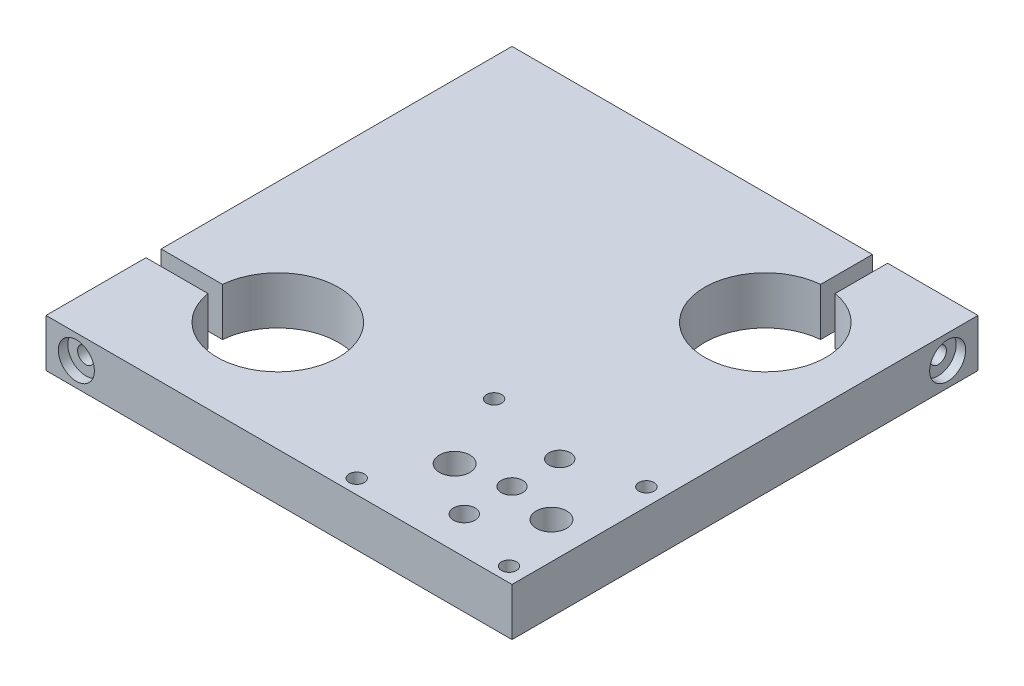
ISO-10303-21;
HEADER;
FILE_DESCRIPTION(('STEP AP214'),'2;1');
FILE_NAME('part.step','',(''),(''),'','','');
FILE_SCHEMA(('AUTOMOTIVE_DESIGN { 1 0 10303 214 1 1 1 1 }'));
ENDSEC;
DATA;
#1=APPLICATION_CONTEXT('core data for automotive mechanical design processes');
#2=APPLICATION_PROTOCOL_DEFINITION('international standard','automotive_design',2000,#1);
#3=PRODUCT_CONTEXT('',#1,'mechanical');
#4=PRODUCT('Part','Part','',(#3));
#5=PRODUCT_RELATED_PRODUCT_CATEGORY('part','',(#4));
#6=PRODUCT_DEFINITION_FORMATION('','',#4);
#7=PRODUCT_DEFINITION_CONTEXT('part definition',#1,'design');
#8=PRODUCT_DEFINITION('design','',#6,#7);
#9=PRODUCT_DEFINITION_SHAPE('','',#8);
#10=(LENGTH_UNIT() NAMED_UNIT(*) SI_UNIT(.MILLI.,.METRE.));
#11=(NAMED_UNIT(*) PLANE_ANGLE_UNIT() SI_UNIT($,.RADIAN.));
#12=(NAMED_UNIT(*) SI_UNIT($,.STERADIAN.) SOLID_ANGLE_UNIT());
#13=UNCERTAINTY_MEASURE_WITH_UNIT(LENGTH_MEASURE(1.E-05),#10,'distance_accuracy_value','');
#14=(GEOMETRIC_REPRESENTATION_CONTEXT(3) GLOBAL_UNCERTAINTY_ASSIGNED_CONTEXT((#13)) GLOBAL_UNIT_ASSIGNED_CONTEXT((#10,
#11,#12)) REPRESENTATION_CONTEXT('',''));
#15=CARTESIAN_POINT('',(0.,0.,0.));
#16=DIRECTION('',(0.,0.,1.));
#17=DIRECTION('',(1.,0.,0.));
#18=AXIS2_PLACEMENT_3D('',#15,#16,#17);
#19=CARTESIAN_POINT('',(0.,0.,0.));
#20=DIRECTION('',(0.,1.,0.));
#21=DIRECTION('',(0.,0.,1.));
#22=AXIS2_PLACEMENT_3D('',#19,#20,#21);
#23=PLANE('',#22);
#24=CARTESIAN_POINT('',(41.13,0.,32.875));
#25=DIRECTION('',(0.,-1.,0.));
#26=DIRECTION('',(0.,0.,-1.));
#27=AXIS2_PLACEMENT_3D('',#24,#25,#26);
#28=CIRCLE('',#27,3.175);
#29=CARTESIAN_POINT('',(41.13,0.,29.7));
#30=VERTEX_POINT('',#29);
#31=EDGE_CURVE('E343',#30,#30,#28,.T.);
#32=ORIENTED_EDGE('',*,*,#31,.F.);
#33=EDGE_LOOP('',(#32));
#34=FACE_BOUND('',#33,.T.);
#35=CARTESIAN_POINT('',(31.,0.,21.01224));
#36=DIRECTION('',(0.,-1.,0.));
#37=DIRECTION('',(0.,0.,-1.));
#38=AXIS2_PLACEMENT_3D('',#35,#36,#37);
#39=CIRCLE('',#38,4.7625);
#40=CARTESIAN_POINT('',(31.,0.,16.24974));
#41=VERTEX_POINT('',#40);
#42=EDGE_CURVE('E325',#41,#41,#39,.T.);
#43=ORIENTED_EDGE('',*,*,#42,.F.);
#44=EDGE_LOOP('',(#43));
#45=FACE_BOUND('',#44,.T.);
#46=CARTESIAN_POINT('',(13.25,0.,45.75));
#47=DIRECTION('',(0.,-1.,0.));
#48=DIRECTION('',(0.,0.,-1.));
#49=AXIS2_PLACEMENT_3D('',#46,#47,#48);
#50=CIRCLE('',#49,1.58749999999999);
#51=CARTESIAN_POINT('',(13.25,0.,44.1625));
#52=VERTEX_POINT('',#51);
#53=EDGE_CURVE('E301',#52,#52,#50,.T.);
#54=ORIENTED_EDGE('',*,*,#53,.F.);
#55=EDGE_LOOP('',(#54));
#56=FACE_BOUND('',#55,.T.);
#57=CARTESIAN_POINT('',(45.12,0.,45.75));
#58=DIRECTION('',(0.,-1.,0.));
#59=DIRECTION('',(0.,0.,-1.));
#60=AXIS2_PLACEMENT_3D('',#57,#58,#59);
#61=CIRCLE('',#60,1.58749999999998);
#62=CARTESIAN_POINT('',(45.12,0.,44.1625));
#63=VERTEX_POINT('',#62);
#64=EDGE_CURVE('E295',#63,#63,#61,.T.);
#65=ORIENTED_EDGE('',*,*,#64,.F.);
#66=EDGE_LOOP('',(#65));
#67=FACE_BOUND('',#66,.T.);
#68=CARTESIAN_POINT('',(45.12,0.,17.));
#69=DIRECTION('',(0.,-1.,0.));
#70=DIRECTION('',(0.,0.,-1.));
#71=AXIS2_PLACEMENT_3D('',#68,#69,#70);
#72=CIRCLE('',#71,1.58749999999998);
#73=CARTESIAN_POINT('',(45.12,0.,15.4125));
#74=VERTEX_POINT('',#73);
#75=EDGE_CURVE('E283',#74,#74,#72,.T.);
#76=ORIENTED_EDGE('',*,*,#75,.F.);
#77=EDGE_LOOP('',(#76));
#78=FACE_BOUND('',#77,.T.);
#79=DIRECTION('',(-1.,0.,0.));
#80=VECTOR('',#79,1.);
#81=CARTESIAN_POINT('',(-48.75,0.,-48.75));
#82=LINE('',#81,#80);
#83=CARTESIAN_POINT('',(26.6625,0.,-48.75));
#84=VERTEX_POINT('',#83);
#85=CARTESIAN_POINT('',(-48.75,0.,-48.75));
#86=VERTEX_POINT('',#85);
#87=EDGE_CURVE('E166',#84,#86,#82,.T.);
#88=ORIENTED_EDGE('',*,*,#87,.F.);
#89=DIRECTION('',(0.,0.,-1.));
#90=VECTOR('',#89,1.);
#91=CARTESIAN_POINT('',(26.6625,0.,48.751));
#92=LINE('',#91,#90);
#93=CARTESIAN_POINT('',(26.6625,0.,-37.9033530635164));
#94=VERTEX_POINT('',#93);
#95=EDGE_CURVE('E127',#94,#84,#92,.T.);
#96=ORIENTED_EDGE('',*,*,#95,.F.);
#97=CARTESIAN_POINT('',(27.75,0.,-25.25));
#98=DIRECTION('',(0.,1.,0.));
#99=DIRECTION('',(0.,0.,1.));
#100=AXIS2_PLACEMENT_3D('',#97,#98,#99);
#101=CIRCLE('',#100,12.7);
#102=CARTESIAN_POINT('',(29.8375,0.,-37.7772640169352));
#103=VERTEX_POINT('',#102);
#104=EDGE_CURVE('E207',#103,#94,#101,.F.);
#105=ORIENTED_EDGE('',*,*,#104,.F.);
#106=DIRECTION('',(0.,0.,-1.));
#107=VECTOR('',#106,1.);
#108=CARTESIAN_POINT('',(29.8375,0.,48.751));
#109=LINE('',#108,#107);
#110=CARTESIAN_POINT('',(29.8375,0.,-48.75));
#111=VERTEX_POINT('',#110);
#112=EDGE_CURVE('E52',#103,#111,#109,.T.);
#113=ORIENTED_EDGE('',*,*,#112,.T.);
#114=CARTESIAN_POINT('',(48.75,0.,-48.75));
#115=VERTEX_POINT('',#114);
#116=EDGE_CURVE('E168',#115,#111,#82,.T.);
#117=ORIENTED_EDGE('',*,*,#116,.F.);
#118=DIRECTION('',(0.,0.,-1.));
#119=VECTOR('',#118,1.);
#120=CARTESIAN_POINT('',(48.75,0.,-48.75));
#121=LINE('',#120,#119);
#122=CARTESIAN_POINT('',(48.75,0.,48.75));
#123=VERTEX_POINT('',#122);
#124=EDGE_CURVE('E163',#123,#115,#121,.T.);
#125=ORIENTED_EDGE('',*,*,#124,.F.);
#126=DIRECTION('',(1.,0.,0.));
#127=VECTOR('',#126,1.);
#128=CARTESIAN_POINT('',(-48.75,0.,48.75));
#129=LINE('',#128,#127);
#130=CARTESIAN_POINT('',(-48.75,0.,48.75));
#131=VERTEX_POINT('',#130);
#132=EDGE_CURVE('E154',#131,#123,#129,.T.);
#133=ORIENTED_EDGE('',*,*,#132,.F.);
#134=DIRECTION('',(0.,0.,1.));
#135=VECTOR('',#134,1.);
#136=CARTESIAN_POINT('',(-48.75,0.,-48.75));
#137=LINE('',#136,#135);
#138=CARTESIAN_POINT('',(-48.75,0.,27.8375));
#139=VERTEX_POINT('',#138);
#140=EDGE_CURVE('E171',#139,#131,#137,.T.);
#141=ORIENTED_EDGE('',*,*,#140,.F.);
#142=DIRECTION('',(-1.,0.,0.));
#143=VECTOR('',#142,1.);
#144=CARTESIAN_POINT('',(48.751,0.,27.8375));
#145=LINE('',#144,#143);
#146=CARTESIAN_POINT('',(-35.7772640169352,0.,27.8375));
#147=VERTEX_POINT('',#146);
#148=EDGE_CURVE('E193',#147,#139,#145,.T.);
#149=ORIENTED_EDGE('',*,*,#148,.F.);
#150=CARTESIAN_POINT('',(-23.25,0.,25.75));
#151=DIRECTION('',(0.,1.,0.));
#152=DIRECTION('',(0.,0.,1.));
#153=AXIS2_PLACEMENT_3D('',#150,#151,#152);
#154=CIRCLE('',#153,12.7);
#155=CARTESIAN_POINT('',(-35.9033530635164,0.,24.6625));
#156=VERTEX_POINT('',#155);
#157=EDGE_CURVE('E167',#156,#147,#154,.F.);
#158=ORIENTED_EDGE('',*,*,#157,.F.);
#159=DIRECTION('',(-1.,0.,0.));
#160=VECTOR('',#159,1.);
#161=CARTESIAN_POINT('',(48.751,0.,24.6625));
#162=LINE('',#161,#160);
#163=CARTESIAN_POINT('',(-48.75,0.,24.6625));
#164=VERTEX_POINT('',#163);
#165=EDGE_CURVE('E188',#156,#164,#162,.T.);
#166=ORIENTED_EDGE('',*,*,#165,.T.);
#167=EDGE_CURVE('E172',#86,#164,#137,.T.);
#168=ORIENTED_EDGE('',*,*,#167,.F.);
#169=EDGE_LOOP('',(#88,#96,#105,#113,#117,#125,#133,#141,#149,#158,#166,#168));
#170=FACE_BOUND('',#169,.T.);
#171=CARTESIAN_POINT('',(13.25,0.,17.));
#172=DIRECTION('',(0.,-1.,0.));
#173=DIRECTION('',(0.,0.,-1.));
#174=AXIS2_PLACEMENT_3D('',#171,#172,#173);
#175=CIRCLE('',#174,1.58749999999999);
#176=CARTESIAN_POINT('',(13.25,0.,15.4125));
#177=VERTEX_POINT('',#176);
#178=EDGE_CURVE('E289',#177,#177,#175,.T.);
#179=ORIENTED_EDGE('',*,*,#178,.F.);
#180=EDGE_LOOP('',(#179));
#181=FACE_BOUND('',#180,.T.);
#182=CARTESIAN_POINT('',(31.,0.,30.9970661848214));
#183=DIRECTION('',(0.,-1.,0.));
#184=DIRECTION('',(0.,0.,-1.));
#185=AXIS2_PLACEMENT_3D('',#182,#183,#184);
#186=CIRCLE('',#185,4.7625);
#187=CARTESIAN_POINT('',(31.,0.,26.2345661848214));
#188=VERTEX_POINT('',#187);
#189=EDGE_CURVE('E313',#188,#188,#186,.T.);
#190=ORIENTED_EDGE('',*,*,#189,.F.);
#191=EDGE_LOOP('',(#190));
#192=FACE_BOUND('',#191,.T.);
#193=CARTESIAN_POINT('',(31.,0.,40.98776));
#194=DIRECTION('',(0.,-1.,0.));
#195=DIRECTION('',(0.,0.,-1.));
#196=AXIS2_PLACEMENT_3D('',#193,#194,#195);
#197=CIRCLE('',#196,4.7625);
#198=CARTESIAN_POINT('',(31.,0.,36.22526));
#199=VERTEX_POINT('',#198);
#200=EDGE_CURVE('E337',#199,#199,#197,.T.);
#201=ORIENTED_EDGE('',*,*,#200,.F.);
#202=EDGE_LOOP('',(#201));
#203=FACE_BOUND('',#202,.T.);
#204=CARTESIAN_POINT('',(20.87,0.,32.875));
#205=DIRECTION('',(0.,-1.,0.));
#206=DIRECTION('',(0.,0.,-1.));
#207=AXIS2_PLACEMENT_3D('',#204,#205,#206);
#208=CIRCLE('',#207,3.175);
#209=CARTESIAN_POINT('',(20.87,0.,29.7));
#210=VERTEX_POINT('',#209);
#211=EDGE_CURVE('E349',#210,#210,#208,.T.);
#212=ORIENTED_EDGE('',*,*,#211,.F.);
#213=EDGE_LOOP('',(#212));
#214=FACE_BOUND('',#213,.T.);
#215=ADVANCED_FACE('F37',(#34,#45,#56,#67,#78,#170,#181,#192,#203,#214),#23,.F.);
#216=CARTESIAN_POINT('',(-48.75,10.,48.75));
#217=DIRECTION('',(0.,0.,-1.));
#218=DIRECTION('',(-1.,0.,0.));
#219=AXIS2_PLACEMENT_3D('',#216,#217,#218);
#220=PLANE('',#219);
#221=ORIENTED_EDGE('',*,*,#132,.T.);
#222=DIRECTION('',(0.,-1.,0.));
#223=VECTOR('',#222,1.);
#224=CARTESIAN_POINT('',(48.75,10.,48.75));
#225=LINE('',#224,#223);
#226=CARTESIAN_POINT('',(48.75,10.,48.75));
#227=VERTEX_POINT('',#226);
#228=EDGE_CURVE('E162',#227,#123,#225,.T.);
#229=ORIENTED_EDGE('',*,*,#228,.F.);
#230=DIRECTION('',(1.,0.,0.));
#231=VECTOR('',#230,1.);
#232=CARTESIAN_POINT('',(-48.75,10.,48.75));
#233=LINE('',#232,#231);
#234=CARTESIAN_POINT('',(-48.75,10.,48.75));
#235=VERTEX_POINT('',#234);
#236=EDGE_CURVE('E160',#235,#227,#233,.T.);
#237=ORIENTED_EDGE('',*,*,#236,.F.);
#238=DIRECTION('',(0.,-1.,0.));
#239=VECTOR('',#238,1.);
#240=CARTESIAN_POINT('',(-48.75,10.,48.75));
#241=LINE('',#240,#239);
#242=EDGE_CURVE('E178',#235,#131,#241,.T.);
#243=ORIENTED_EDGE('',*,*,#242,.T.);
#244=EDGE_LOOP('',(#221,#229,#237,#243));
#245=FACE_BOUND('',#244,.T.);
#246=CARTESIAN_POINT('',(-42.4,5.,48.75));
#247=DIRECTION('',(0.,0.,1.));
#248=DIRECTION('',(1.,0.,0.));
#249=AXIS2_PLACEMENT_3D('',#246,#247,#248);
#250=CIRCLE('',#249,3.77062999999999);
#251=CARTESIAN_POINT('',(-38.62937,5.,48.75));
#252=VERTEX_POINT('',#251);
#253=EDGE_CURVE('E265',#252,#252,#250,.T.);
#254=ORIENTED_EDGE('',*,*,#253,.F.);
#255=EDGE_LOOP('',(#254));
#256=FACE_BOUND('',#255,.T.);
#257=ADVANCED_FACE('F243',(#245,#256),#220,.F.);
#258=CARTESIAN_POINT('',(48.751,0.,27.8375));
#259=DIRECTION('',(0.,0.,1.));
#260=DIRECTION('',(1.,0.,0.));
#261=AXIS2_PLACEMENT_3D('',#258,#259,#260);
#262=PLANE('',#261);
#263=DIRECTION('',(0.,1.,0.));
#264=VECTOR('',#263,1.);
#265=CARTESIAN_POINT('',(-35.7772640169352,-0.000999999999999265,27.8375));
#266=LINE('',#265,#264);
#267=CARTESIAN_POINT('',(-35.7772640169352,10.,27.8375));
#268=VERTEX_POINT('',#267);
#269=EDGE_CURVE('E214',#268,#147,#266,.F.);
#270=ORIENTED_EDGE('',*,*,#269,.T.);
#271=ORIENTED_EDGE('',*,*,#148,.T.);
#272=DIRECTION('',(0.,1.,0.));
#273=VECTOR('',#272,1.);
#274=CARTESIAN_POINT('',(-48.75,0.,27.8375));
#275=LINE('',#274,#273);
#276=CARTESIAN_POINT('',(-48.75,9.99999999999999,27.8375));
#277=VERTEX_POINT('',#276);
#278=EDGE_CURVE('E223',#139,#277,#275,.T.);
#279=ORIENTED_EDGE('',*,*,#278,.T.);
#280=DIRECTION('',(-1.,0.,0.));
#281=VECTOR('',#280,1.);
#282=CARTESIAN_POINT('',(48.751,9.99999999999999,27.8375));
#283=LINE('',#282,#281);
#284=EDGE_CURVE('E196',#268,#277,#283,.T.);
#285=ORIENTED_EDGE('',*,*,#284,.F.);
#286=EDGE_LOOP('',(#270,#271,#279,#285));
#287=FACE_BOUND('',#286,.T.);
#288=CARTESIAN_POINT('',(-42.4,5.,27.8375));
#289=DIRECTION('',(0.,0.,1.));
#290=DIRECTION('',(1.,0.,0.));
#291=AXIS2_PLACEMENT_3D('',#288,#289,#290);
#292=CIRCLE('',#291,1.7272);
#293=CARTESIAN_POINT('',(-40.6728,5.,27.8375));
#294=VERTEX_POINT('',#293);
#295=EDGE_CURVE('E253',#294,#294,#292,.F.);
#296=ORIENTED_EDGE('',*,*,#295,.F.);
#297=EDGE_LOOP('',(#296));
#298=FACE_BOUND('',#297,.T.);
#299=ADVANCED_FACE('F231',(#287,#298),#262,.F.);
#300=CARTESIAN_POINT('',(-48.75,10.,-48.75));
#301=DIRECTION('',(0.,0.,1.));
#302=DIRECTION('',(1.,0.,0.));
#303=AXIS2_PLACEMENT_3D('',#300,#301,#302);
#304=PLANE('',#303);
#305=DIRECTION('',(-1.,0.,0.));
#306=VECTOR('',#305,1.);
#307=CARTESIAN_POINT('',(-48.75,10.,-48.75));
#308=LINE('',#307,#306);
#309=CARTESIAN_POINT('',(26.6625,10.,-48.75));
#310=VERTEX_POINT('',#309);
#311=CARTESIAN_POINT('',(-48.75,10.,-48.75));
#312=VERTEX_POINT('',#311);
#313=EDGE_CURVE('E138',#310,#312,#308,.T.);
#314=ORIENTED_EDGE('',*,*,#313,.F.);
#315=DIRECTION('',(0.,1.,0.));
#316=VECTOR('',#315,1.);
#317=CARTESIAN_POINT('',(26.6625,10.,-48.75));
#318=LINE('',#317,#316);
#319=EDGE_CURVE('E124',#84,#310,#318,.T.);
#320=ORIENTED_EDGE('',*,*,#319,.F.);
#321=ORIENTED_EDGE('',*,*,#87,.T.);
#322=DIRECTION('',(0.,-1.,0.));
#323=VECTOR('',#322,1.);
#324=CARTESIAN_POINT('',(-48.75,10.,-48.75));
#325=LINE('',#324,#323);
#326=EDGE_CURVE('E45',#312,#86,#325,.T.);
#327=ORIENTED_EDGE('',*,*,#326,.F.);
#328=EDGE_LOOP('',(#314,#320,#321,#327));
#329=FACE_BOUND('',#328,.T.);
#330=ADVANCED_FACE('F145',(#329),#304,.F.);
#331=CARTESIAN_POINT('',(-48.75,10.,-48.75));
#332=DIRECTION('',(1.,0.,0.));
#333=DIRECTION('',(0.,0.,-1.));
#334=AXIS2_PLACEMENT_3D('',#331,#332,#333);
#335=PLANE('',#334);
#336=ORIENTED_EDGE('',*,*,#167,.T.);
#337=DIRECTION('',(0.,-1.,0.));
#338=VECTOR('',#337,1.);
#339=CARTESIAN_POINT('',(-48.75,0.,24.6625));
#340=LINE('',#339,#338);
#341=CARTESIAN_POINT('',(-48.75,10.,24.6625));
#342=VERTEX_POINT('',#341);
#343=EDGE_CURVE('E198',#342,#164,#340,.T.);
#344=ORIENTED_EDGE('',*,*,#343,.F.);
#345=DIRECTION('',(0.,0.,1.));
#346=VECTOR('',#345,1.);
#347=CARTESIAN_POINT('',(-48.75,10.,-48.75));
#348=LINE('',#347,#346);
#349=EDGE_CURVE('E158',#312,#342,#348,.T.);
#350=ORIENTED_EDGE('',*,*,#349,.F.);
#351=ORIENTED_EDGE('',*,*,#326,.T.);
#352=EDGE_LOOP('',(#336,#344,#350,#351));
#353=FACE_BOUND('',#352,.T.);
#354=ADVANCED_FACE('F182',(#353),#335,.F.);
#355=CARTESIAN_POINT('',(48.75,10.,-48.75));
#356=DIRECTION('',(-1.,0.,0.));
#357=DIRECTION('',(0.,0.,1.));
#358=AXIS2_PLACEMENT_3D('',#355,#356,#357);
#359=PLANE('',#358);
#360=CARTESIAN_POINT('',(48.75,5.,-42.4));
#361=DIRECTION('',(1.,0.,0.));
#362=DIRECTION('',(0.,0.,-1.));
#363=AXIS2_PLACEMENT_3D('',#360,#361,#362);
#364=CIRCLE('',#363,3.77062999999999);
#365=CARTESIAN_POINT('',(48.75,5.,-46.17063));
#366=VERTEX_POINT('',#365);
#367=EDGE_CURVE('E272',#366,#366,#364,.T.);
#368=ORIENTED_EDGE('',*,*,#367,.F.);
#369=EDGE_LOOP('',(#368));
#370=FACE_BOUND('',#369,.T.);
#371=ORIENTED_EDGE('',*,*,#124,.T.);
#372=DIRECTION('',(0.,-1.,0.));
#373=VECTOR('',#372,1.);
#374=CARTESIAN_POINT('',(48.75,10.,-48.75));
#375=LINE('',#374,#373);
#376=CARTESIAN_POINT('',(48.75,10.,-48.75));
#377=VERTEX_POINT('',#376);
#378=EDGE_CURVE('E11',#377,#115,#375,.T.);
#379=ORIENTED_EDGE('',*,*,#378,.F.);
#380=DIRECTION('',(0.,0.,-1.));
#381=VECTOR('',#380,1.);
#382=CARTESIAN_POINT('',(48.75,10.,-48.75));
#383=LINE('',#382,#381);
#384=EDGE_CURVE('E149',#227,#377,#383,.T.);
#385=ORIENTED_EDGE('',*,*,#384,.F.);
#386=ORIENTED_EDGE('',*,*,#228,.T.);
#387=EDGE_LOOP('',(#371,#379,#385,#386));
#388=FACE_BOUND('',#387,.T.);
#389=ADVANCED_FACE('F39',(#370,#388),#359,.F.);
#390=ORIENTED_EDGE('',*,*,#116,.T.);
#391=DIRECTION('',(0.,-1.,0.));
#392=VECTOR('',#391,1.);
#393=CARTESIAN_POINT('',(29.8375,10.,-48.75));
#394=LINE('',#393,#392);
#395=CARTESIAN_POINT('',(29.8375,10.,-48.75));
#396=VERTEX_POINT('',#395);
#397=EDGE_CURVE('E131',#396,#111,#394,.T.);
#398=ORIENTED_EDGE('',*,*,#397,.F.);
#399=EDGE_CURVE('E148',#377,#396,#308,.T.);
#400=ORIENTED_EDGE('',*,*,#399,.F.);
#401=ORIENTED_EDGE('',*,*,#378,.T.);
#402=EDGE_LOOP('',(#390,#398,#400,#401));
#403=FACE_BOUND('',#402,.T.);
#404=ADVANCED_FACE('F250',(#403),#304,.F.);
#405=EDGE_CURVE('E152',#277,#235,#348,.T.);
#406=ORIENTED_EDGE('',*,*,#405,.F.);
#407=ORIENTED_EDGE('',*,*,#278,.F.);
#408=ORIENTED_EDGE('',*,*,#140,.T.);
#409=ORIENTED_EDGE('',*,*,#242,.F.);
#410=EDGE_LOOP('',(#406,#407,#408,#409));
#411=FACE_BOUND('',#410,.T.);
#412=ADVANCED_FACE('F240',(#411),#335,.F.);
#413=CARTESIAN_POINT('',(0.,10.,0.));
#414=DIRECTION('',(0.,1.,0.));
#415=DIRECTION('',(0.,0.,1.));
#416=AXIS2_PLACEMENT_3D('',#413,#414,#415);
#417=PLANE('',#416);
#418=CARTESIAN_POINT('',(20.87,10.,32.875));
#419=DIRECTION('',(0.,1.,0.));
#420=DIRECTION('',(0.,0.,1.));
#421=AXIS2_PLACEMENT_3D('',#418,#419,#420);
#422=CIRCLE('',#421,3.175);
#423=CARTESIAN_POINT('',(20.87,10.,36.05));
#424=VERTEX_POINT('',#423);
#425=EDGE_CURVE('E346',#424,#424,#422,.T.);
#426=ORIENTED_EDGE('',*,*,#425,.F.);
#427=EDGE_LOOP('',(#426));
#428=FACE_BOUND('',#427,.T.);
#429=CARTESIAN_POINT('',(41.13,10.,32.875));
#430=DIRECTION('',(0.,1.,0.));
#431=DIRECTION('',(0.,0.,1.));
#432=AXIS2_PLACEMENT_3D('',#429,#430,#431);
#433=CIRCLE('',#432,3.175);
#434=CARTESIAN_POINT('',(41.13,10.,36.05));
#435=VERTEX_POINT('',#434);
#436=EDGE_CURVE('E340',#435,#435,#433,.T.);
#437=ORIENTED_EDGE('',*,*,#436,.F.);
#438=EDGE_LOOP('',(#437));
#439=FACE_BOUND('',#438,.T.);
#440=CARTESIAN_POINT('',(31.,10.,40.98776));
#441=DIRECTION('',(0.,1.,0.));
#442=DIRECTION('',(0.,0.,1.));
#443=AXIS2_PLACEMENT_3D('',#440,#441,#442);
#444=CIRCLE('',#443,2.2479);
#445=CARTESIAN_POINT('',(31.,10.,43.23566));
#446=VERTEX_POINT('',#445);
#447=EDGE_CURVE('E328',#446,#446,#444,.T.);
#448=ORIENTED_EDGE('',*,*,#447,.F.);
#449=EDGE_LOOP('',(#448));
#450=FACE_BOUND('',#449,.T.);
#451=CARTESIAN_POINT('',(31.,10.,21.01224));
#452=DIRECTION('',(0.,1.,0.));
#453=DIRECTION('',(0.,0.,1.));
#454=AXIS2_PLACEMENT_3D('',#451,#452,#453);
#455=CIRCLE('',#454,2.2479);
#456=CARTESIAN_POINT('',(31.,10.,23.26014));
#457=VERTEX_POINT('',#456);
#458=EDGE_CURVE('E316',#457,#457,#455,.T.);
#459=ORIENTED_EDGE('',*,*,#458,.F.);
#460=EDGE_LOOP('',(#459));
#461=FACE_BOUND('',#460,.T.);
#462=CARTESIAN_POINT('',(31.,10.,30.9970661848214));
#463=DIRECTION('',(0.,1.,0.));
#464=DIRECTION('',(0.,0.,1.));
#465=AXIS2_PLACEMENT_3D('',#462,#463,#464);
#466=CIRCLE('',#465,2.2479);
#467=CARTESIAN_POINT('',(31.,10.,33.2449661848214));
#468=VERTEX_POINT('',#467);
#469=EDGE_CURVE('E304',#468,#468,#466,.T.);
#470=ORIENTED_EDGE('',*,*,#469,.F.);
#471=EDGE_LOOP('',(#470));
#472=FACE_BOUND('',#471,.T.);
#473=CARTESIAN_POINT('',(13.25,10.,45.75));
#474=DIRECTION('',(0.,1.,0.));
#475=DIRECTION('',(0.,0.,1.));
#476=AXIS2_PLACEMENT_3D('',#473,#474,#475);
#477=CIRCLE('',#476,1.58749999999999);
#478=CARTESIAN_POINT('',(13.25,10.,47.3375));
#479=VERTEX_POINT('',#478);
#480=EDGE_CURVE('E298',#479,#479,#477,.T.);
#481=ORIENTED_EDGE('',*,*,#480,.F.);
#482=EDGE_LOOP('',(#481));
#483=FACE_BOUND('',#482,.T.);
#484=CARTESIAN_POINT('',(45.12,10.,45.75));
#485=DIRECTION('',(0.,1.,0.));
#486=DIRECTION('',(0.,0.,1.));
#487=AXIS2_PLACEMENT_3D('',#484,#485,#486);
#488=CIRCLE('',#487,1.58749999999999);
#489=CARTESIAN_POINT('',(45.12,10.,47.3375));
#490=VERTEX_POINT('',#489);
#491=EDGE_CURVE('E292',#490,#490,#488,.T.);
#492=ORIENTED_EDGE('',*,*,#491,.F.);
#493=EDGE_LOOP('',(#492));
#494=FACE_BOUND('',#493,.T.);
#495=CARTESIAN_POINT('',(13.25,10.,17.));
#496=DIRECTION('',(0.,1.,0.));
#497=DIRECTION('',(0.,0.,1.));
#498=AXIS2_PLACEMENT_3D('',#495,#496,#497);
#499=CIRCLE('',#498,1.58749999999999);
#500=CARTESIAN_POINT('',(13.25,10.,18.5875));
#501=VERTEX_POINT('',#500);
#502=EDGE_CURVE('E286',#501,#501,#499,.T.);
#503=ORIENTED_EDGE('',*,*,#502,.F.);
#504=EDGE_LOOP('',(#503));
#505=FACE_BOUND('',#504,.T.);
#506=CARTESIAN_POINT('',(45.12,10.,17.));
#507=DIRECTION('',(0.,1.,0.));
#508=DIRECTION('',(0.,0.,1.));
#509=AXIS2_PLACEMENT_3D('',#506,#507,#508);
#510=CIRCLE('',#509,1.58749999999999);
#511=CARTESIAN_POINT('',(45.12,10.,18.5875));
#512=VERTEX_POINT('',#511);
#513=EDGE_CURVE('E276',#512,#512,#510,.T.);
#514=ORIENTED_EDGE('',*,*,#513,.F.);
#515=EDGE_LOOP('',(#514));
#516=FACE_BOUND('',#515,.T.);
#517=DIRECTION('',(0.,0.,-1.));
#518=VECTOR('',#517,1.);
#519=CARTESIAN_POINT('',(26.6625,10.,48.751));
#520=LINE('',#519,#518);
#521=CARTESIAN_POINT('',(26.6625,10.,-37.9033530635164));
#522=VERTEX_POINT('',#521);
#523=EDGE_CURVE('E60',#522,#310,#520,.T.);
#524=ORIENTED_EDGE('',*,*,#523,.T.);
#525=ORIENTED_EDGE('',*,*,#313,.T.);
#526=ORIENTED_EDGE('',*,*,#349,.T.);
#527=DIRECTION('',(-1.,0.,0.));
#528=VECTOR('',#527,1.);
#529=CARTESIAN_POINT('',(48.751,10.,24.6625));
#530=LINE('',#529,#528);
#531=CARTESIAN_POINT('',(-35.9033530635164,10.,24.6625));
#532=VERTEX_POINT('',#531);
#533=EDGE_CURVE('E194',#532,#342,#530,.T.);
#534=ORIENTED_EDGE('',*,*,#533,.F.);
#535=CARTESIAN_POINT('',(-23.25,10.,25.75));
#536=DIRECTION('',(0.,1.,0.));
#537=DIRECTION('',(0.,0.,1.));
#538=AXIS2_PLACEMENT_3D('',#535,#536,#537);
#539=CIRCLE('',#538,12.7);
#540=EDGE_CURVE('E204',#268,#532,#539,.T.);
#541=ORIENTED_EDGE('',*,*,#540,.F.);
#542=ORIENTED_EDGE('',*,*,#284,.T.);
#543=ORIENTED_EDGE('',*,*,#405,.T.);
#544=ORIENTED_EDGE('',*,*,#236,.T.);
#545=ORIENTED_EDGE('',*,*,#384,.T.);
#546=ORIENTED_EDGE('',*,*,#399,.T.);
#547=DIRECTION('',(0.,0.,-1.));
#548=VECTOR('',#547,1.);
#549=CARTESIAN_POINT('',(29.8375,10.,48.751));
#550=LINE('',#549,#548);
#551=CARTESIAN_POINT('',(29.8375,10.,-37.7772640169352));
#552=VERTEX_POINT('',#551);
#553=EDGE_CURVE('E143',#552,#396,#550,.T.);
#554=ORIENTED_EDGE('',*,*,#553,.F.);
#555=CARTESIAN_POINT('',(27.75,10.,-25.25));
#556=DIRECTION('',(0.,1.,0.));
#557=DIRECTION('',(0.,0.,1.));
#558=AXIS2_PLACEMENT_3D('',#555,#556,#557);
#559=CIRCLE('',#558,12.7);
#560=EDGE_CURVE('E142',#522,#552,#559,.T.);
#561=ORIENTED_EDGE('',*,*,#560,.F.);
#562=EDGE_LOOP('',(#524,#525,#526,#534,#541,#542,#543,#544,#545,#546,#554,#561));
#563=FACE_BOUND('',#562,.T.);
#564=ADVANCED_FACE('F136',(#428,#439,#450,#461,#472,#483,#494,#505,#516,#563),#417,.T.);
#565=CARTESIAN_POINT('',(27.75,-0.000999999999999265,-25.25));
#566=DIRECTION('',(0.,1.,0.));
#567=DIRECTION('',(0.,0.,1.));
#568=AXIS2_PLACEMENT_3D('',#565,#566,#567);
#569=CYLINDRICAL_SURFACE('',#568,12.7);
#570=ORIENTED_EDGE('',*,*,#104,.T.);
#571=DIRECTION('',(0.,1.,0.));
#572=VECTOR('',#571,1.);
#573=CARTESIAN_POINT('',(26.6625,-0.000999999999999265,-37.9033530635164));
#574=LINE('',#573,#572);
#575=EDGE_CURVE('E132',#522,#94,#574,.F.);
#576=ORIENTED_EDGE('',*,*,#575,.F.);
#577=ORIENTED_EDGE('',*,*,#560,.T.);
#578=DIRECTION('',(0.,1.,0.));
#579=VECTOR('',#578,1.);
#580=CARTESIAN_POINT('',(29.8375,-0.000999999999999265,-37.7772640169352));
#581=LINE('',#580,#579);
#582=EDGE_CURVE('E213',#103,#552,#581,.T.);
#583=ORIENTED_EDGE('',*,*,#582,.F.);
#584=EDGE_LOOP('',(#570,#576,#577,#583));
#585=FACE_BOUND('',#584,.T.);
#586=ADVANCED_FACE('F212',(#585),#569,.F.);
#587=CARTESIAN_POINT('',(-23.25,-0.000999999999999265,25.75));
#588=DIRECTION('',(0.,1.,0.));
#589=DIRECTION('',(0.,0.,1.));
#590=AXIS2_PLACEMENT_3D('',#587,#588,#589);
#591=CYLINDRICAL_SURFACE('',#590,12.7);
#592=ORIENTED_EDGE('',*,*,#540,.T.);
#593=DIRECTION('',(0.,1.,0.));
#594=VECTOR('',#593,1.);
#595=CARTESIAN_POINT('',(-35.9033530635164,-0.000999999999999265,24.6625));
#596=LINE('',#595,#594);
#597=EDGE_CURVE('E216',#156,#532,#596,.T.);
#598=ORIENTED_EDGE('',*,*,#597,.F.);
#599=ORIENTED_EDGE('',*,*,#157,.T.);
#600=ORIENTED_EDGE('',*,*,#269,.F.);
#601=EDGE_LOOP('',(#592,#598,#599,#600));
#602=FACE_BOUND('',#601,.T.);
#603=ADVANCED_FACE('F229',(#602),#591,.F.);
#604=CARTESIAN_POINT('',(48.751,0.,24.6625));
#605=DIRECTION('',(0.,0.,-1.));
#606=DIRECTION('',(-1.,0.,0.));
#607=AXIS2_PLACEMENT_3D('',#604,#605,#606);
#608=PLANE('',#607);
#609=ORIENTED_EDGE('',*,*,#597,.T.);
#610=ORIENTED_EDGE('',*,*,#533,.T.);
#611=ORIENTED_EDGE('',*,*,#343,.T.);
#612=ORIENTED_EDGE('',*,*,#165,.F.);
#613=EDGE_LOOP('',(#609,#610,#611,#612));
#614=FACE_BOUND('',#613,.T.);
#615=ADVANCED_FACE('F225',(#614),#608,.F.);
#616=CARTESIAN_POINT('',(29.8375,10.,48.751));
#617=DIRECTION('',(1.,0.,0.));
#618=DIRECTION('',(0.,0.,-1.));
#619=AXIS2_PLACEMENT_3D('',#616,#617,#618);
#620=PLANE('',#619);
#621=CARTESIAN_POINT('',(29.8375,5.,-42.4));
#622=DIRECTION('',(1.,0.,0.));
#623=DIRECTION('',(0.,0.,-1.));
#624=AXIS2_PLACEMENT_3D('',#621,#622,#623);
#625=CIRCLE('',#624,1.7272);
#626=CARTESIAN_POINT('',(29.8375,5.,-44.1272));
#627=VERTEX_POINT('',#626);
#628=EDGE_CURVE('E267',#627,#627,#625,.T.);
#629=ORIENTED_EDGE('',*,*,#628,.T.);
#630=EDGE_LOOP('',(#629));
#631=FACE_BOUND('',#630,.T.);
#632=ORIENTED_EDGE('',*,*,#582,.T.);
#633=ORIENTED_EDGE('',*,*,#553,.T.);
#634=ORIENTED_EDGE('',*,*,#397,.T.);
#635=ORIENTED_EDGE('',*,*,#112,.F.);
#636=EDGE_LOOP('',(#632,#633,#634,#635));
#637=FACE_BOUND('',#636,.T.);
#638=ADVANCED_FACE('F252',(#631,#637),#620,.F.);
#639=CARTESIAN_POINT('',(26.6625,10.,48.751));
#640=DIRECTION('',(-1.,0.,0.));
#641=DIRECTION('',(0.,0.,1.));
#642=AXIS2_PLACEMENT_3D('',#639,#640,#641);
#643=PLANE('',#642);
#644=ORIENTED_EDGE('',*,*,#575,.T.);
#645=ORIENTED_EDGE('',*,*,#95,.T.);
#646=ORIENTED_EDGE('',*,*,#319,.T.);
#647=ORIENTED_EDGE('',*,*,#523,.F.);
#648=EDGE_LOOP('',(#644,#645,#646,#647));
#649=FACE_BOUND('',#648,.T.);
#650=ADVANCED_FACE('F125',(#649),#643,.F.);
#651=CARTESIAN_POINT('',(-42.4,5.,48.75));
#652=DIRECTION('',(0.,0.,1.));
#653=DIRECTION('',(1.,0.,0.));
#654=AXIS2_PLACEMENT_3D('',#651,#652,#653);
#655=CYLINDRICAL_SURFACE('',#654,1.7272);
#656=ORIENTED_EDGE('',*,*,#295,.T.);
#657=EDGE_LOOP('',(#656));
#658=FACE_BOUND('',#657,.T.);
#659=CARTESIAN_POINT('',(-42.4,5.,46.7688));
#660=DIRECTION('',(0.,0.,1.));
#661=DIRECTION('',(1.,0.,0.));
#662=AXIS2_PLACEMENT_3D('',#659,#660,#661);
#663=CIRCLE('',#662,1.7272);
#664=CARTESIAN_POINT('',(-40.6728,5.,46.7688));
#665=VERTEX_POINT('',#664);
#666=EDGE_CURVE('E257',#665,#665,#663,.T.);
#667=ORIENTED_EDGE('',*,*,#666,.T.);
#668=EDGE_LOOP('',(#667));
#669=FACE_BOUND('',#668,.T.);
#670=ADVANCED_FACE('F445',(#658,#669),#655,.F.);
#671=CARTESIAN_POINT('',(-40.6728,5.,46.7688));
#672=DIRECTION('',(0.,0.,-1.));
#673=DIRECTION('',(-1.,0.,0.));
#674=AXIS2_PLACEMENT_3D('',#671,#672,#673);
#675=PLANE('',#674);
#676=ORIENTED_EDGE('',*,*,#666,.F.);
#677=EDGE_LOOP('',(#676));
#678=FACE_BOUND('',#677,.T.);
#679=CARTESIAN_POINT('',(-42.4,5.,46.7688));
#680=DIRECTION('',(0.,0.,1.));
#681=DIRECTION('',(1.,0.,0.));
#682=AXIS2_PLACEMENT_3D('',#679,#680,#681);
#683=CIRCLE('',#682,3.77063);
#684=CARTESIAN_POINT('',(-38.62937,5.,46.7688));
#685=VERTEX_POINT('',#684);
#686=EDGE_CURVE('E262',#685,#685,#683,.T.);
#687=ORIENTED_EDGE('',*,*,#686,.T.);
#688=EDGE_LOOP('',(#687));
#689=FACE_BOUND('',#688,.T.);
#690=ADVANCED_FACE('F441',(#678,#689),#675,.F.);
#691=CARTESIAN_POINT('',(-42.4,5.,48.75));
#692=DIRECTION('',(0.,0.,1.));
#693=DIRECTION('',(1.,0.,0.));
#694=AXIS2_PLACEMENT_3D('',#691,#692,#693);
#695=CYLINDRICAL_SURFACE('',#694,3.77062999999999);
#696=ORIENTED_EDGE('',*,*,#686,.F.);
#697=EDGE_LOOP('',(#696));
#698=FACE_BOUND('',#697,.T.);
#699=ORIENTED_EDGE('',*,*,#253,.T.);
#700=EDGE_LOOP('',(#699));
#701=FACE_BOUND('',#700,.T.);
#702=ADVANCED_FACE('F434',(#698,#701),#695,.F.);
#703=CARTESIAN_POINT('',(48.75,5.,-42.4));
#704=DIRECTION('',(1.,0.,0.));
#705=DIRECTION('',(0.,0.,-1.));
#706=AXIS2_PLACEMENT_3D('',#703,#704,#705);
#707=CYLINDRICAL_SURFACE('',#706,1.7272);
#708=CARTESIAN_POINT('',(46.7688,5.,-42.4));
#709=DIRECTION('',(1.,0.,0.));
#710=DIRECTION('',(0.,0.,-1.));
#711=AXIS2_PLACEMENT_3D('',#708,#709,#710);
#712=CIRCLE('',#711,1.7272);
#713=CARTESIAN_POINT('',(46.7688,5.,-44.1272));
#714=VERTEX_POINT('',#713);
#715=EDGE_CURVE('E275',#714,#714,#712,.T.);
#716=ORIENTED_EDGE('',*,*,#715,.T.);
#717=EDGE_LOOP('',(#716));
#718=FACE_BOUND('',#717,.T.);
#719=ORIENTED_EDGE('',*,*,#628,.F.);
#720=EDGE_LOOP('',(#719));
#721=FACE_BOUND('',#720,.T.);
#722=ADVANCED_FACE('F431',(#718,#721),#707,.F.);
#723=CARTESIAN_POINT('',(46.7688,6.7272,-42.4));
#724=DIRECTION('',(-1.,0.,0.));
#725=DIRECTION('',(0.,0.,1.));
#726=AXIS2_PLACEMENT_3D('',#723,#724,#725);
#727=PLANE('',#726);
#728=ORIENTED_EDGE('',*,*,#715,.F.);
#729=EDGE_LOOP('',(#728));
#730=FACE_BOUND('',#729,.T.);
#731=CARTESIAN_POINT('',(46.7688,5.,-42.4));
#732=DIRECTION('',(1.,0.,0.));
#733=DIRECTION('',(0.,0.,-1.));
#734=AXIS2_PLACEMENT_3D('',#731,#732,#733);
#735=CIRCLE('',#734,3.77062999999999);
#736=CARTESIAN_POINT('',(46.7688,5.,-46.17063));
#737=VERTEX_POINT('',#736);
#738=EDGE_CURVE('E271',#737,#737,#735,.T.);
#739=ORIENTED_EDGE('',*,*,#738,.T.);
#740=EDGE_LOOP('',(#739));
#741=FACE_BOUND('',#740,.T.);
#742=ADVANCED_FACE('F426',(#730,#741),#727,.F.);
#743=CARTESIAN_POINT('',(48.75,5.,-42.4));
#744=DIRECTION('',(1.,0.,0.));
#745=DIRECTION('',(0.,0.,-1.));
#746=AXIS2_PLACEMENT_3D('',#743,#744,#745);
#747=CYLINDRICAL_SURFACE('',#746,3.77062999999999);
#748=ORIENTED_EDGE('',*,*,#738,.F.);
#749=EDGE_LOOP('',(#748));
#750=FACE_BOUND('',#749,.T.);
#751=ORIENTED_EDGE('',*,*,#367,.T.);
#752=EDGE_LOOP('',(#751));
#753=FACE_BOUND('',#752,.T.);
#754=ADVANCED_FACE('F416',(#750,#753),#747,.F.);
#755=CARTESIAN_POINT('',(45.12,0.,17.));
#756=DIRECTION('',(0.,-1.,0.));
#757=DIRECTION('',(0.,0.,-1.));
#758=AXIS2_PLACEMENT_3D('',#755,#756,#757);
#759=CYLINDRICAL_SURFACE('',#758,1.58749999999999);
#760=ORIENTED_EDGE('',*,*,#75,.T.);
#761=EDGE_LOOP('',(#760));
#762=FACE_BOUND('',#761,.T.);
#763=ORIENTED_EDGE('',*,*,#513,.T.);
#764=EDGE_LOOP('',(#763));
#765=FACE_BOUND('',#764,.T.);
#766=ADVANCED_FACE('F413',(#762,#765),#759,.F.);
#767=CARTESIAN_POINT('',(13.25,0.,17.));
#768=DIRECTION('',(0.,-1.,0.));
#769=DIRECTION('',(0.,0.,-1.));
#770=AXIS2_PLACEMENT_3D('',#767,#768,#769);
#771=CYLINDRICAL_SURFACE('',#770,1.58749999999999);
#772=ORIENTED_EDGE('',*,*,#178,.T.);
#773=EDGE_LOOP('',(#772));
#774=FACE_BOUND('',#773,.T.);
#775=ORIENTED_EDGE('',*,*,#502,.T.);
#776=EDGE_LOOP('',(#775));
#777=FACE_BOUND('',#776,.T.);
#778=ADVANCED_FACE('F415',(#774,#777),#771,.F.);
#779=CARTESIAN_POINT('',(45.12,0.,45.75));
#780=DIRECTION('',(0.,-1.,0.));
#781=DIRECTION('',(0.,0.,-1.));
#782=AXIS2_PLACEMENT_3D('',#779,#780,#781);
#783=CYLINDRICAL_SURFACE('',#782,1.58749999999999);
#784=ORIENTED_EDGE('',*,*,#64,.T.);
#785=EDGE_LOOP('',(#784));
#786=FACE_BOUND('',#785,.T.);
#787=ORIENTED_EDGE('',*,*,#491,.T.);
#788=EDGE_LOOP('',(#787));
#789=FACE_BOUND('',#788,.T.);
#790=ADVANCED_FACE('F423',(#786,#789),#783,.F.);
#791=CARTESIAN_POINT('',(13.25,0.,45.75));
#792=DIRECTION('',(0.,-1.,0.));
#793=DIRECTION('',(0.,0.,-1.));
#794=AXIS2_PLACEMENT_3D('',#791,#792,#793);
#795=CYLINDRICAL_SURFACE('',#794,1.58749999999999);
#796=ORIENTED_EDGE('',*,*,#53,.T.);
#797=EDGE_LOOP('',(#796));
#798=FACE_BOUND('',#797,.T.);
#799=ORIENTED_EDGE('',*,*,#480,.T.);
#800=EDGE_LOOP('',(#799));
#801=FACE_BOUND('',#800,.T.);
#802=ADVANCED_FACE('F502',(#798,#801),#795,.F.);
#803=CARTESIAN_POINT('',(31.,0.,30.9970661848214));
#804=DIRECTION('',(0.,-1.,0.));
#805=DIRECTION('',(0.,0.,-1.));
#806=AXIS2_PLACEMENT_3D('',#803,#804,#805);
#807=CYLINDRICAL_SURFACE('',#806,2.2479);
#808=CARTESIAN_POINT('',(31.,2.667,30.9970661848214));
#809=DIRECTION('',(0.,-1.,0.));
#810=DIRECTION('',(0.,0.,-1.));
#811=AXIS2_PLACEMENT_3D('',#808,#809,#810);
#812=CIRCLE('',#811,2.2479);
#813=CARTESIAN_POINT('',(31.,2.667,28.7491661848214));
#814=VERTEX_POINT('',#813);
#815=EDGE_CURVE('E307',#814,#814,#812,.T.);
#816=ORIENTED_EDGE('',*,*,#815,.T.);
#817=EDGE_LOOP('',(#816));
#818=FACE_BOUND('',#817,.T.);
#819=ORIENTED_EDGE('',*,*,#469,.T.);
#820=EDGE_LOOP('',(#819));
#821=FACE_BOUND('',#820,.T.);
#822=ADVANCED_FACE('F511',(#818,#821),#807,.F.);
#823=CARTESIAN_POINT('',(33.2479,2.667,30.9970661848214));
#824=DIRECTION('',(0.,1.,0.));
#825=DIRECTION('',(0.,0.,1.));
#826=AXIS2_PLACEMENT_3D('',#823,#824,#825);
#827=PLANE('',#826);
#828=ORIENTED_EDGE('',*,*,#815,.F.);
#829=EDGE_LOOP('',(#828));
#830=FACE_BOUND('',#829,.T.);
#831=CARTESIAN_POINT('',(31.,2.667,30.9970661848214));
#832=DIRECTION('',(0.,-1.,0.));
#833=DIRECTION('',(0.,0.,-1.));
#834=AXIS2_PLACEMENT_3D('',#831,#832,#833);
#835=CIRCLE('',#834,4.7625);
#836=CARTESIAN_POINT('',(31.,2.667,26.2345661848214));
#837=VERTEX_POINT('',#836);
#838=EDGE_CURVE('E310',#837,#837,#835,.T.);
#839=ORIENTED_EDGE('',*,*,#838,.T.);
#840=EDGE_LOOP('',(#839));
#841=FACE_BOUND('',#840,.T.);
#842=ADVANCED_FACE('F521',(#830,#841),#827,.F.);
#843=CARTESIAN_POINT('',(31.,0.,30.9970661848214));
#844=DIRECTION('',(0.,-1.,0.));
#845=DIRECTION('',(0.,0.,-1.));
#846=AXIS2_PLACEMENT_3D('',#843,#844,#845);
#847=CYLINDRICAL_SURFACE('',#846,4.7625);
#848=ORIENTED_EDGE('',*,*,#838,.F.);
#849=EDGE_LOOP('',(#848));
#850=FACE_BOUND('',#849,.T.);
#851=ORIENTED_EDGE('',*,*,#189,.T.);
#852=EDGE_LOOP('',(#851));
#853=FACE_BOUND('',#852,.T.);
#854=ADVANCED_FACE('F531',(#850,#853),#847,.F.);
#855=CARTESIAN_POINT('',(31.,0.,21.01224));
#856=DIRECTION('',(0.,-1.,0.));
#857=DIRECTION('',(0.,0.,-1.));
#858=AXIS2_PLACEMENT_3D('',#855,#856,#857);
#859=CYLINDRICAL_SURFACE('',#858,2.2479);
#860=CARTESIAN_POINT('',(31.,2.667,21.01224));
#861=DIRECTION('',(0.,-1.,0.));
#862=DIRECTION('',(0.,0.,-1.));
#863=AXIS2_PLACEMENT_3D('',#860,#861,#862);
#864=CIRCLE('',#863,2.2479);
#865=CARTESIAN_POINT('',(31.,2.667,18.76434));
#866=VERTEX_POINT('',#865);
#867=EDGE_CURVE('E319',#866,#866,#864,.T.);
#868=ORIENTED_EDGE('',*,*,#867,.T.);
#869=EDGE_LOOP('',(#868));
#870=FACE_BOUND('',#869,.T.);
#871=ORIENTED_EDGE('',*,*,#458,.T.);
#872=EDGE_LOOP('',(#871));
#873=FACE_BOUND('',#872,.T.);
#874=ADVANCED_FACE('F541',(#870,#873),#859,.F.);
#875=CARTESIAN_POINT('',(33.2479,2.667,21.01224));
#876=DIRECTION('',(0.,1.,0.));
#877=DIRECTION('',(0.,0.,1.));
#878=AXIS2_PLACEMENT_3D('',#875,#876,#877);
#879=PLANE('',#878);
#880=ORIENTED_EDGE('',*,*,#867,.F.);
#881=EDGE_LOOP('',(#880));
#882=FACE_BOUND('',#881,.T.);
#883=CARTESIAN_POINT('',(31.,2.667,21.01224));
#884=DIRECTION('',(0.,-1.,0.));
#885=DIRECTION('',(0.,0.,-1.));
#886=AXIS2_PLACEMENT_3D('',#883,#884,#885);
#887=CIRCLE('',#886,4.7625);
#888=CARTESIAN_POINT('',(31.,2.667,16.24974));
#889=VERTEX_POINT('',#888);
#890=EDGE_CURVE('E322',#889,#889,#887,.T.);
#891=ORIENTED_EDGE('',*,*,#890,.T.);
#892=EDGE_LOOP('',(#891));
#893=FACE_BOUND('',#892,.T.);
#894=ADVANCED_FACE('F551',(#882,#893),#879,.F.);
#895=CARTESIAN_POINT('',(31.,0.,21.01224));
#896=DIRECTION('',(0.,-1.,0.));
#897=DIRECTION('',(0.,0.,-1.));
#898=AXIS2_PLACEMENT_3D('',#895,#896,#897);
#899=CYLINDRICAL_SURFACE('',#898,4.7625);
#900=ORIENTED_EDGE('',*,*,#890,.F.);
#901=EDGE_LOOP('',(#900));
#902=FACE_BOUND('',#901,.T.);
#903=ORIENTED_EDGE('',*,*,#42,.T.);
#904=EDGE_LOOP('',(#903));
#905=FACE_BOUND('',#904,.T.);
#906=ADVANCED_FACE('F561',(#902,#905),#899,.F.);
#907=CARTESIAN_POINT('',(31.,0.,40.98776));
#908=DIRECTION('',(0.,-1.,0.));
#909=DIRECTION('',(0.,0.,-1.));
#910=AXIS2_PLACEMENT_3D('',#907,#908,#909);
#911=CYLINDRICAL_SURFACE('',#910,2.2479);
#912=CARTESIAN_POINT('',(31.,2.667,40.98776));
#913=DIRECTION('',(0.,-1.,0.));
#914=DIRECTION('',(0.,0.,-1.));
#915=AXIS2_PLACEMENT_3D('',#912,#913,#914);
#916=CIRCLE('',#915,2.2479);
#917=CARTESIAN_POINT('',(31.,2.667,38.73986));
#918=VERTEX_POINT('',#917);
#919=EDGE_CURVE('E331',#918,#918,#916,.T.);
#920=ORIENTED_EDGE('',*,*,#919,.T.);
#921=EDGE_LOOP('',(#920));
#922=FACE_BOUND('',#921,.T.);
#923=ORIENTED_EDGE('',*,*,#447,.T.);
#924=EDGE_LOOP('',(#923));
#925=FACE_BOUND('',#924,.T.);
#926=ADVANCED_FACE('F571',(#922,#925),#911,.F.);
#927=CARTESIAN_POINT('',(33.2479,2.667,40.98776));
#928=DIRECTION('',(0.,1.,0.));
#929=DIRECTION('',(0.,0.,1.));
#930=AXIS2_PLACEMENT_3D('',#927,#928,#929);
#931=PLANE('',#930);
#932=ORIENTED_EDGE('',*,*,#919,.F.);
#933=EDGE_LOOP('',(#932));
#934=FACE_BOUND('',#933,.T.);
#935=CARTESIAN_POINT('',(31.,2.667,40.98776));
#936=DIRECTION('',(0.,-1.,0.));
#937=DIRECTION('',(0.,0.,-1.));
#938=AXIS2_PLACEMENT_3D('',#935,#936,#937);
#939=CIRCLE('',#938,4.7625);
#940=CARTESIAN_POINT('',(31.,2.667,36.22526));
#941=VERTEX_POINT('',#940);
#942=EDGE_CURVE('E334',#941,#941,#939,.T.);
#943=ORIENTED_EDGE('',*,*,#942,.T.);
#944=EDGE_LOOP('',(#943));
#945=FACE_BOUND('',#944,.T.);
#946=ADVANCED_FACE('F581',(#934,#945),#931,.F.);
#947=CARTESIAN_POINT('',(31.,0.,40.98776));
#948=DIRECTION('',(0.,-1.,0.));
#949=DIRECTION('',(0.,0.,-1.));
#950=AXIS2_PLACEMENT_3D('',#947,#948,#949);
#951=CYLINDRICAL_SURFACE('',#950,4.7625);
#952=ORIENTED_EDGE('',*,*,#942,.F.);
#953=EDGE_LOOP('',(#952));
#954=FACE_BOUND('',#953,.T.);
#955=ORIENTED_EDGE('',*,*,#200,.T.);
#956=EDGE_LOOP('',(#955));
#957=FACE_BOUND('',#956,.T.);
#958=ADVANCED_FACE('F591',(#954,#957),#951,.F.);
#959=CARTESIAN_POINT('',(41.13,0.,32.875));
#960=DIRECTION('',(0.,-1.,0.));
#961=DIRECTION('',(0.,0.,-1.));
#962=AXIS2_PLACEMENT_3D('',#959,#960,#961);
#963=CYLINDRICAL_SURFACE('',#962,3.175);
#964=ORIENTED_EDGE('',*,*,#31,.T.);
#965=EDGE_LOOP('',(#964));
#966=FACE_BOUND('',#965,.T.);
#967=ORIENTED_EDGE('',*,*,#436,.T.);
#968=EDGE_LOOP('',(#967));
#969=FACE_BOUND('',#968,.T.);
#970=ADVANCED_FACE('F600',(#966,#969),#963,.F.);
#971=CARTESIAN_POINT('',(20.87,0.,32.875));
#972=DIRECTION('',(0.,-1.,0.));
#973=DIRECTION('',(0.,0.,-1.));
#974=AXIS2_PLACEMENT_3D('',#971,#972,#973);
#975=CYLINDRICAL_SURFACE('',#974,3.175);
#976=ORIENTED_EDGE('',*,*,#211,.T.);
#977=EDGE_LOOP('',(#976));
#978=FACE_BOUND('',#977,.T.);
#979=ORIENTED_EDGE('',*,*,#425,.T.);
#980=EDGE_LOOP('',(#979));
#981=FACE_BOUND('',#980,.T.);
#982=ADVANCED_FACE('F353',(#978,#981),#975,.F.);
#983=CLOSED_SHELL('',(#215,#257,#299,#330,#354,#389,#404,#412,#564,#586,#603,#615,#638,#650,
#670,#690,#702,#722,#742,#754,#766,#778,#790,#802,#822,#842,#854,#874,#894,#906,#926,#946,#958,
#970,#982));
#984=MANIFOLD_SOLID_BREP('B2',#983);
#985=ADVANCED_BREP_SHAPE_REPRESENTATION('',(#18,#984),#14);
#986=SHAPE_DEFINITION_REPRESENTATION(#9,#985);
ENDSEC;
END-ISO-10303-21;
